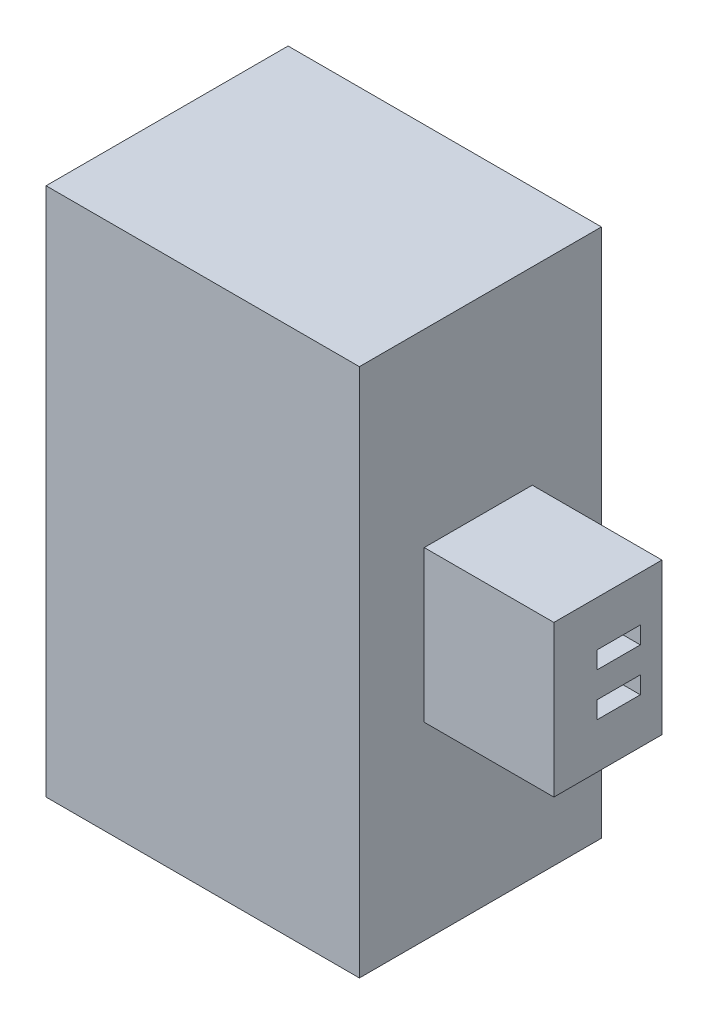
ISO-10303-21;
HEADER;
FILE_DESCRIPTION(('STEP AP214'),'2;1');
FILE_NAME('part.step','',(''),(''),'','','');
FILE_SCHEMA(('AUTOMOTIVE_DESIGN { 1 0 10303 214 1 1 1 1 }'));
ENDSEC;
DATA;
#1=APPLICATION_CONTEXT('core data for automotive mechanical design processes');
#2=APPLICATION_PROTOCOL_DEFINITION('international standard','automotive_design',2000,#1);
#3=PRODUCT_CONTEXT('',#1,'mechanical');
#4=PRODUCT('Part','Part','',(#3));
#5=PRODUCT_RELATED_PRODUCT_CATEGORY('part','',(#4));
#6=PRODUCT_DEFINITION_FORMATION('','',#4);
#7=PRODUCT_DEFINITION_CONTEXT('part definition',#1,'design');
#8=PRODUCT_DEFINITION('design','',#6,#7);
#9=PRODUCT_DEFINITION_SHAPE('','',#8);
#10=(LENGTH_UNIT() NAMED_UNIT(*) SI_UNIT(.MILLI.,.METRE.));
#11=(NAMED_UNIT(*) PLANE_ANGLE_UNIT() SI_UNIT($,.RADIAN.));
#12=(NAMED_UNIT(*) SI_UNIT($,.STERADIAN.) SOLID_ANGLE_UNIT());
#13=UNCERTAINTY_MEASURE_WITH_UNIT(LENGTH_MEASURE(1.E-05),#10,'distance_accuracy_value','');
#14=(GEOMETRIC_REPRESENTATION_CONTEXT(3) GLOBAL_UNCERTAINTY_ASSIGNED_CONTEXT((#13)) GLOBAL_UNIT_ASSIGNED_CONTEXT((#10,
#11,#12)) REPRESENTATION_CONTEXT('',''));
#15=CARTESIAN_POINT('',(0.,0.,0.));
#16=DIRECTION('',(0.,0.,1.));
#17=DIRECTION('',(1.,0.,0.));
#18=AXIS2_PLACEMENT_3D('',#15,#16,#17);
#19=CARTESIAN_POINT('',(0.,0.,5.6));
#20=DIRECTION('',(1.,0.,0.));
#21=DIRECTION('',(0.,0.,-1.));
#22=AXIS2_PLACEMENT_3D('',#19,#20,#21);
#23=PLANE('',#22);
#24=DIRECTION('',(0.,1.,0.));
#25=VECTOR('',#24,1.);
#26=CARTESIAN_POINT('',(0.,-1.62170824512628,4.85));
#27=LINE('',#26,#25);
#28=CARTESIAN_POINT('',(0.,0.750000000000001,4.85));
#29=VERTEX_POINT('',#28);
#30=CARTESIAN_POINT('',(0.,11.5,4.85));
#31=VERTEX_POINT('',#30);
#32=EDGE_CURVE('E172',#29,#31,#27,.T.);
#33=ORIENTED_EDGE('',*,*,#32,.T.);
#34=DIRECTION('',(0.,0.,1.));
#35=VECTOR('',#34,1.);
#36=CARTESIAN_POINT('',(0.,11.5,5.6));
#37=LINE('',#36,#35);
#38=CARTESIAN_POINT('',(0.,11.5,0.));
#39=VERTEX_POINT('',#38);
#40=EDGE_CURVE('E197',#39,#31,#37,.T.);
#41=ORIENTED_EDGE('',*,*,#40,.F.);
#42=DIRECTION('',(0.,-1.,0.));
#43=VECTOR('',#42,1.);
#44=CARTESIAN_POINT('',(0.,0.,0.));
#45=LINE('',#44,#43);
#46=CARTESIAN_POINT('',(0.,0.750000000000001,0.));
#47=VERTEX_POINT('',#46);
#48=EDGE_CURVE('E185',#39,#47,#45,.T.);
#49=ORIENTED_EDGE('',*,*,#48,.T.);
#50=DIRECTION('',(0.,0.,-1.));
#51=VECTOR('',#50,1.);
#52=CARTESIAN_POINT('',(0.,0.750000000000001,5.6));
#53=LINE('',#52,#51);
#54=EDGE_CURVE('E57',#29,#47,#53,.T.);
#55=ORIENTED_EDGE('',*,*,#54,.F.);
#56=EDGE_LOOP('',(#33,#41,#49,#55));
#57=FACE_BOUND('',#56,.T.);
#58=ADVANCED_FACE('F33',(#57),#23,.F.);
#59=CARTESIAN_POINT('',(-2.25,11.5,5.6));
#60=DIRECTION('',(0.,1.,0.));
#61=DIRECTION('',(0.,0.,1.));
#62=AXIS2_PLACEMENT_3D('',#59,#60,#61);
#63=PLANE('',#62);
#64=DIRECTION('',(1.,0.,0.));
#65=VECTOR('',#64,1.);
#66=CARTESIAN_POINT('',(-2.25,11.5,4.85));
#67=LINE('',#66,#65);
#68=CARTESIAN_POINT('',(-2.25,11.5,4.85));
#69=VERTEX_POINT('',#68);
#70=EDGE_CURVE('E177',#69,#31,#67,.T.);
#71=ORIENTED_EDGE('',*,*,#70,.F.);
#72=DIRECTION('',(0.,0.,1.));
#73=VECTOR('',#72,1.);
#74=CARTESIAN_POINT('',(-2.25,11.5,5.6));
#75=LINE('',#74,#73);
#76=CARTESIAN_POINT('',(-2.25,11.5,0.));
#77=VERTEX_POINT('',#76);
#78=EDGE_CURVE('E206',#77,#69,#75,.T.);
#79=ORIENTED_EDGE('',*,*,#78,.F.);
#80=DIRECTION('',(1.,0.,0.));
#81=VECTOR('',#80,1.);
#82=CARTESIAN_POINT('',(-2.25,11.5,0.));
#83=LINE('',#82,#81);
#84=EDGE_CURVE('E208',#77,#39,#83,.T.);
#85=ORIENTED_EDGE('',*,*,#84,.T.);
#86=ORIENTED_EDGE('',*,*,#40,.T.);
#87=EDGE_LOOP('',(#71,#79,#85,#86));
#88=FACE_BOUND('',#87,.T.);
#89=ADVANCED_FACE('F378',(#88),#63,.F.);
#90=CARTESIAN_POINT('',(-2.25,0.750000000000001,5.6));
#91=DIRECTION('',(0.,-1.,0.));
#92=DIRECTION('',(0.,0.,-1.));
#93=AXIS2_PLACEMENT_3D('',#90,#91,#92);
#94=PLANE('',#93);
#95=DIRECTION('',(1.,0.,0.));
#96=VECTOR('',#95,1.);
#97=CARTESIAN_POINT('',(-2.25,0.750000000000001,4.85));
#98=LINE('',#97,#96);
#99=CARTESIAN_POINT('',(-2.25,0.750000000000001,4.85));
#100=VERTEX_POINT('',#99);
#101=EDGE_CURVE('E174',#100,#29,#98,.T.);
#102=ORIENTED_EDGE('',*,*,#101,.T.);
#103=ORIENTED_EDGE('',*,*,#54,.T.);
#104=DIRECTION('',(1.,0.,0.));
#105=VECTOR('',#104,1.);
#106=CARTESIAN_POINT('',(-2.25,0.750000000000001,0.));
#107=LINE('',#106,#105);
#108=CARTESIAN_POINT('',(-2.25,0.750000000000001,0.));
#109=VERTEX_POINT('',#108);
#110=EDGE_CURVE('E195',#109,#47,#107,.T.);
#111=ORIENTED_EDGE('',*,*,#110,.F.);
#112=DIRECTION('',(0.,0.,-1.));
#113=VECTOR('',#112,1.);
#114=CARTESIAN_POINT('',(-2.25,0.750000000000001,5.6));
#115=LINE('',#114,#113);
#116=EDGE_CURVE('E182',#100,#109,#115,.T.);
#117=ORIENTED_EDGE('',*,*,#116,.F.);
#118=EDGE_LOOP('',(#102,#103,#111,#117));
#119=FACE_BOUND('',#118,.T.);
#120=ADVANCED_FACE('F181',(#119),#94,.F.);
#121=CARTESIAN_POINT('',(5.,0.,5.6));
#122=DIRECTION('',(-1.,0.,0.));
#123=DIRECTION('',(0.,0.,1.));
#124=AXIS2_PLACEMENT_3D('',#121,#122,#123);
#125=PLANE('',#124);
#126=DIRECTION('',(0.,1.,0.));
#127=VECTOR('',#126,1.);
#128=CARTESIAN_POINT('',(5.,0.,0.));
#129=LINE('',#128,#127);
#130=CARTESIAN_POINT('',(5.,0.,0.));
#131=VERTEX_POINT('',#130);
#132=CARTESIAN_POINT('',(5.,12.25,0.));
#133=VERTEX_POINT('',#132);
#134=EDGE_CURVE('E320',#131,#133,#129,.T.);
#135=ORIENTED_EDGE('',*,*,#134,.T.);
#136=DIRECTION('',(0.,0.,-1.));
#137=VECTOR('',#136,1.);
#138=CARTESIAN_POINT('',(5.,12.25,5.6));
#139=LINE('',#138,#137);
#140=CARTESIAN_POINT('',(5.,12.25,5.6));
#141=VERTEX_POINT('',#140);
#142=EDGE_CURVE('E41',#141,#133,#139,.T.);
#143=ORIENTED_EDGE('',*,*,#142,.F.);
#144=DIRECTION('',(0.,1.,0.));
#145=VECTOR('',#144,1.);
#146=CARTESIAN_POINT('',(5.,0.,5.6));
#147=LINE('',#146,#145);
#148=CARTESIAN_POINT('',(5.,0.,5.6));
#149=VERTEX_POINT('',#148);
#150=EDGE_CURVE('E312',#149,#141,#147,.T.);
#151=ORIENTED_EDGE('',*,*,#150,.F.);
#152=DIRECTION('',(0.,0.,-1.));
#153=VECTOR('',#152,1.);
#154=CARTESIAN_POINT('',(5.,0.,5.6));
#155=LINE('',#154,#153);
#156=EDGE_CURVE('E11',#149,#131,#155,.T.);
#157=ORIENTED_EDGE('',*,*,#156,.T.);
#158=EDGE_LOOP('',(#135,#143,#151,#157));
#159=FACE_BOUND('',#158,.T.);
#160=DIRECTION('',(0.,-1.,0.));
#161=VECTOR('',#160,1.);
#162=CARTESIAN_POINT('',(5.,7.875,4.1));
#163=LINE('',#162,#161);
#164=CARTESIAN_POINT('',(5.,7.875,4.1));
#165=VERTEX_POINT('',#164);
#166=CARTESIAN_POINT('',(5.,4.375,4.1));
#167=VERTEX_POINT('',#166);
#168=EDGE_CURVE('E277',#165,#167,#163,.T.);
#169=ORIENTED_EDGE('',*,*,#168,.F.);
#170=DIRECTION('',(0.,0.,1.));
#171=VECTOR('',#170,1.);
#172=CARTESIAN_POINT('',(5.,7.875,4.1));
#173=LINE('',#172,#171);
#174=CARTESIAN_POINT('',(5.,7.875,1.6));
#175=VERTEX_POINT('',#174);
#176=EDGE_CURVE('E282',#175,#165,#173,.T.);
#177=ORIENTED_EDGE('',*,*,#176,.F.);
#178=DIRECTION('',(0.,1.,0.));
#179=VECTOR('',#178,1.);
#180=CARTESIAN_POINT('',(5.,7.875,1.6));
#181=LINE('',#180,#179);
#182=CARTESIAN_POINT('',(5.,4.375,1.6));
#183=VERTEX_POINT('',#182);
#184=EDGE_CURVE('E294',#183,#175,#181,.T.);
#185=ORIENTED_EDGE('',*,*,#184,.F.);
#186=DIRECTION('',(0.,0.,-1.));
#187=VECTOR('',#186,1.);
#188=CARTESIAN_POINT('',(5.,4.375,4.1));
#189=LINE('',#188,#187);
#190=EDGE_CURVE('E291',#167,#183,#189,.T.);
#191=ORIENTED_EDGE('',*,*,#190,.F.);
#192=EDGE_LOOP('',(#169,#177,#185,#191));
#193=FACE_BOUND('',#192,.T.);
#194=ADVANCED_FACE('F345',(#159,#193),#125,.F.);
#195=CARTESIAN_POINT('',(0.,0.,5.6));
#196=DIRECTION('',(0.,1.,0.));
#197=DIRECTION('',(0.,0.,1.));
#198=AXIS2_PLACEMENT_3D('',#195,#196,#197);
#199=PLANE('',#198);
#200=DIRECTION('',(1.,0.,0.));
#201=VECTOR('',#200,1.);
#202=CARTESIAN_POINT('',(0.,0.,0.));
#203=LINE('',#202,#201);
#204=CARTESIAN_POINT('',(-2.25,0.,0.));
#205=VERTEX_POINT('',#204);
#206=EDGE_CURVE('E318',#205,#131,#203,.T.);
#207=ORIENTED_EDGE('',*,*,#206,.T.);
#208=ORIENTED_EDGE('',*,*,#156,.F.);
#209=DIRECTION('',(1.,0.,0.));
#210=VECTOR('',#209,1.);
#211=CARTESIAN_POINT('',(0.,0.,5.6));
#212=LINE('',#211,#210);
#213=CARTESIAN_POINT('',(-2.25,0.,5.6));
#214=VERTEX_POINT('',#213);
#215=EDGE_CURVE('E310',#214,#149,#212,.T.);
#216=ORIENTED_EDGE('',*,*,#215,.F.);
#217=DIRECTION('',(0.,0.,1.));
#218=VECTOR('',#217,1.);
#219=CARTESIAN_POINT('',(-2.25,0.,5.6));
#220=LINE('',#219,#218);
#221=EDGE_CURVE('E187',#205,#214,#220,.T.);
#222=ORIENTED_EDGE('',*,*,#221,.F.);
#223=EDGE_LOOP('',(#207,#208,#216,#222));
#224=FACE_BOUND('',#223,.T.);
#225=ADVANCED_FACE('F344',(#224),#199,.F.);
#226=CARTESIAN_POINT('',(0.,12.25,5.6));
#227=DIRECTION('',(0.,-1.,0.));
#228=DIRECTION('',(0.,0.,-1.));
#229=AXIS2_PLACEMENT_3D('',#226,#227,#228);
#230=PLANE('',#229);
#231=DIRECTION('',(-1.,0.,0.));
#232=VECTOR('',#231,1.);
#233=CARTESIAN_POINT('',(0.,12.25,0.));
#234=LINE('',#233,#232);
#235=CARTESIAN_POINT('',(-2.25,12.25,0.));
#236=VERTEX_POINT('',#235);
#237=EDGE_CURVE('E313',#133,#236,#234,.T.);
#238=ORIENTED_EDGE('',*,*,#237,.T.);
#239=DIRECTION('',(0.,0.,-1.));
#240=VECTOR('',#239,1.);
#241=CARTESIAN_POINT('',(-2.25,12.25,5.6));
#242=LINE('',#241,#240);
#243=CARTESIAN_POINT('',(-2.25,12.25,5.6));
#244=VERTEX_POINT('',#243);
#245=EDGE_CURVE('E201',#244,#236,#242,.T.);
#246=ORIENTED_EDGE('',*,*,#245,.F.);
#247=DIRECTION('',(-1.,0.,0.));
#248=VECTOR('',#247,1.);
#249=CARTESIAN_POINT('',(0.,12.25,5.6));
#250=LINE('',#249,#248);
#251=EDGE_CURVE('E315',#141,#244,#250,.T.);
#252=ORIENTED_EDGE('',*,*,#251,.F.);
#253=ORIENTED_EDGE('',*,*,#142,.T.);
#254=EDGE_LOOP('',(#238,#246,#252,#253));
#255=FACE_BOUND('',#254,.T.);
#256=ADVANCED_FACE('F328',(#255),#230,.F.);
#257=CARTESIAN_POINT('',(0.,0.,5.6));
#258=DIRECTION('',(0.,0.,-1.));
#259=DIRECTION('',(-1.,0.,0.));
#260=AXIS2_PLACEMENT_3D('',#257,#258,#259);
#261=PLANE('',#260);
#262=ORIENTED_EDGE('',*,*,#251,.T.);
#263=DIRECTION('',(0.,1.,0.));
#264=VECTOR('',#263,1.);
#265=CARTESIAN_POINT('',(-2.25,12.25,5.6));
#266=LINE('',#265,#264);
#267=EDGE_CURVE('E198',#214,#244,#266,.T.);
#268=ORIENTED_EDGE('',*,*,#267,.F.);
#269=ORIENTED_EDGE('',*,*,#215,.T.);
#270=ORIENTED_EDGE('',*,*,#150,.T.);
#271=EDGE_LOOP('',(#262,#268,#269,#270));
#272=FACE_BOUND('',#271,.T.);
#273=ADVANCED_FACE('F341',(#272),#261,.F.);
#274=CARTESIAN_POINT('',(0.,0.,0.));
#275=DIRECTION('',(0.,0.,-1.));
#276=DIRECTION('',(-1.,0.,0.));
#277=AXIS2_PLACEMENT_3D('',#274,#275,#276);
#278=PLANE('',#277);
#279=ORIENTED_EDGE('',*,*,#48,.F.);
#280=ORIENTED_EDGE('',*,*,#84,.F.);
#281=DIRECTION('',(0.,-1.,0.));
#282=VECTOR('',#281,1.);
#283=CARTESIAN_POINT('',(-2.25,12.25,0.));
#284=LINE('',#283,#282);
#285=EDGE_CURVE('E204',#236,#77,#284,.T.);
#286=ORIENTED_EDGE('',*,*,#285,.F.);
#287=ORIENTED_EDGE('',*,*,#237,.F.);
#288=ORIENTED_EDGE('',*,*,#134,.F.);
#289=ORIENTED_EDGE('',*,*,#206,.F.);
#290=DIRECTION('',(0.,-1.,0.));
#291=VECTOR('',#290,1.);
#292=CARTESIAN_POINT('',(-2.25,0.,0.));
#293=LINE('',#292,#291);
#294=EDGE_CURVE('E193',#109,#205,#293,.T.);
#295=ORIENTED_EDGE('',*,*,#294,.F.);
#296=ORIENTED_EDGE('',*,*,#110,.T.);
#297=EDGE_LOOP('',(#279,#280,#286,#287,#288,#289,#295,#296));
#298=FACE_BOUND('',#297,.T.);
#299=ADVANCED_FACE('F335',(#298),#278,.T.);
#300=CARTESIAN_POINT('',(8.,0.,0.));
#301=DIRECTION('',(1.,0.,0.));
#302=DIRECTION('',(0.,0.,-1.));
#303=AXIS2_PLACEMENT_3D('',#300,#301,#302);
#304=PLANE('',#303);
#305=DIRECTION('',(0.,0.,-1.));
#306=VECTOR('',#305,1.);
#307=CARTESIAN_POINT('',(8.,6.425,3.1));
#308=LINE('',#307,#306);
#309=CARTESIAN_POINT('',(8.,6.425,3.1));
#310=VERTEX_POINT('',#309);
#311=CARTESIAN_POINT('',(8.,6.425,2.1));
#312=VERTEX_POINT('',#311);
#313=EDGE_CURVE('E250',#310,#312,#308,.T.);
#314=ORIENTED_EDGE('',*,*,#313,.F.);
#315=DIRECTION('',(0.,-1.,0.));
#316=VECTOR('',#315,1.);
#317=CARTESIAN_POINT('',(8.,6.825,3.1));
#318=LINE('',#317,#316);
#319=CARTESIAN_POINT('',(8.,6.825,3.1));
#320=VERTEX_POINT('',#319);
#321=EDGE_CURVE('E248',#320,#310,#318,.T.);
#322=ORIENTED_EDGE('',*,*,#321,.F.);
#323=DIRECTION('',(0.,0.,1.));
#324=VECTOR('',#323,1.);
#325=CARTESIAN_POINT('',(8.,6.825,3.1));
#326=LINE('',#325,#324);
#327=CARTESIAN_POINT('',(8.,6.825,2.1));
#328=VERTEX_POINT('',#327);
#329=EDGE_CURVE('E256',#328,#320,#326,.T.);
#330=ORIENTED_EDGE('',*,*,#329,.F.);
#331=DIRECTION('',(0.,1.,0.));
#332=VECTOR('',#331,1.);
#333=CARTESIAN_POINT('',(8.,6.825,2.1));
#334=LINE('',#333,#332);
#335=EDGE_CURVE('E253',#312,#328,#334,.T.);
#336=ORIENTED_EDGE('',*,*,#335,.F.);
#337=EDGE_LOOP('',(#314,#322,#330,#336));
#338=FACE_BOUND('',#337,.T.);
#339=DIRECTION('',(0.,-1.,0.));
#340=VECTOR('',#339,1.);
#341=CARTESIAN_POINT('',(8.,7.875,4.1));
#342=LINE('',#341,#340);
#343=CARTESIAN_POINT('',(8.,7.875,4.1));
#344=VERTEX_POINT('',#343);
#345=CARTESIAN_POINT('',(8.,4.375,4.1));
#346=VERTEX_POINT('',#345);
#347=EDGE_CURVE('E278',#344,#346,#342,.T.);
#348=ORIENTED_EDGE('',*,*,#347,.T.);
#349=DIRECTION('',(0.,0.,-1.));
#350=VECTOR('',#349,1.);
#351=CARTESIAN_POINT('',(8.,4.375,4.1));
#352=LINE('',#351,#350);
#353=CARTESIAN_POINT('',(8.,4.375,1.6));
#354=VERTEX_POINT('',#353);
#355=EDGE_CURVE('E281',#346,#354,#352,.T.);
#356=ORIENTED_EDGE('',*,*,#355,.T.);
#357=DIRECTION('',(0.,1.,0.));
#358=VECTOR('',#357,1.);
#359=CARTESIAN_POINT('',(8.,7.875,1.6));
#360=LINE('',#359,#358);
#361=CARTESIAN_POINT('',(8.,7.875,1.6));
#362=VERTEX_POINT('',#361);
#363=EDGE_CURVE('E284',#354,#362,#360,.T.);
#364=ORIENTED_EDGE('',*,*,#363,.T.);
#365=DIRECTION('',(0.,0.,1.));
#366=VECTOR('',#365,1.);
#367=CARTESIAN_POINT('',(8.,7.875,4.1));
#368=LINE('',#367,#366);
#369=EDGE_CURVE('E286',#362,#344,#368,.T.);
#370=ORIENTED_EDGE('',*,*,#369,.T.);
#371=EDGE_LOOP('',(#348,#356,#364,#370));
#372=FACE_BOUND('',#371,.T.);
#373=DIRECTION('',(0.,0.,-1.));
#374=VECTOR('',#373,1.);
#375=CARTESIAN_POINT('',(8.,5.425,3.1));
#376=LINE('',#375,#374);
#377=CARTESIAN_POINT('',(8.,5.425,3.1));
#378=VERTEX_POINT('',#377);
#379=CARTESIAN_POINT('',(8.,5.425,2.1));
#380=VERTEX_POINT('',#379);
#381=EDGE_CURVE('E617',#378,#380,#376,.T.);
#382=ORIENTED_EDGE('',*,*,#381,.F.);
#383=DIRECTION('',(0.,-1.,0.));
#384=VECTOR('',#383,1.);
#385=CARTESIAN_POINT('',(8.,5.425,3.1));
#386=LINE('',#385,#384);
#387=CARTESIAN_POINT('',(8.,5.825,3.1));
#388=VERTEX_POINT('',#387);
#389=EDGE_CURVE('E211',#388,#378,#386,.T.);
#390=ORIENTED_EDGE('',*,*,#389,.F.);
#391=DIRECTION('',(0.,0.,1.));
#392=VECTOR('',#391,1.);
#393=CARTESIAN_POINT('',(8.,5.825,3.1));
#394=LINE('',#393,#392);
#395=CARTESIAN_POINT('',(8.,5.825,2.1));
#396=VERTEX_POINT('',#395);
#397=EDGE_CURVE('E231',#396,#388,#394,.T.);
#398=ORIENTED_EDGE('',*,*,#397,.F.);
#399=DIRECTION('',(0.,1.,0.));
#400=VECTOR('',#399,1.);
#401=CARTESIAN_POINT('',(8.,5.425,2.1));
#402=LINE('',#401,#400);
#403=EDGE_CURVE('E620',#380,#396,#402,.T.);
#404=ORIENTED_EDGE('',*,*,#403,.F.);
#405=EDGE_LOOP('',(#382,#390,#398,#404));
#406=FACE_BOUND('',#405,.T.);
#407=ADVANCED_FACE('F361',(#338,#372,#406),#304,.T.);
#408=CARTESIAN_POINT('',(8.,7.875,4.1));
#409=DIRECTION('',(0.,0.,-1.));
#410=DIRECTION('',(-1.,0.,0.));
#411=AXIS2_PLACEMENT_3D('',#408,#409,#410);
#412=PLANE('',#411);
#413=ORIENTED_EDGE('',*,*,#168,.T.);
#414=DIRECTION('',(-1.,0.,0.));
#415=VECTOR('',#414,1.);
#416=CARTESIAN_POINT('',(8.,4.375,4.1));
#417=LINE('',#416,#415);
#418=EDGE_CURVE('E307',#346,#167,#417,.T.);
#419=ORIENTED_EDGE('',*,*,#418,.F.);
#420=ORIENTED_EDGE('',*,*,#347,.F.);
#421=DIRECTION('',(-1.,0.,0.));
#422=VECTOR('',#421,1.);
#423=CARTESIAN_POINT('',(8.,7.875,4.1));
#424=LINE('',#423,#422);
#425=EDGE_CURVE('E288',#344,#165,#424,.T.);
#426=ORIENTED_EDGE('',*,*,#425,.T.);
#427=EDGE_LOOP('',(#413,#419,#420,#426));
#428=FACE_BOUND('',#427,.T.);
#429=ADVANCED_FACE('F359',(#428),#412,.F.);
#430=CARTESIAN_POINT('',(8.,4.375,4.1));
#431=DIRECTION('',(0.,1.,0.));
#432=DIRECTION('',(0.,0.,1.));
#433=AXIS2_PLACEMENT_3D('',#430,#431,#432);
#434=PLANE('',#433);
#435=ORIENTED_EDGE('',*,*,#190,.T.);
#436=DIRECTION('',(-1.,0.,0.));
#437=VECTOR('',#436,1.);
#438=CARTESIAN_POINT('',(8.,4.375,1.6));
#439=LINE('',#438,#437);
#440=EDGE_CURVE('E304',#354,#183,#439,.T.);
#441=ORIENTED_EDGE('',*,*,#440,.F.);
#442=ORIENTED_EDGE('',*,*,#355,.F.);
#443=ORIENTED_EDGE('',*,*,#418,.T.);
#444=EDGE_LOOP('',(#435,#441,#442,#443));
#445=FACE_BOUND('',#444,.T.);
#446=ADVANCED_FACE('F368',(#445),#434,.F.);
#447=CARTESIAN_POINT('',(8.,7.875,1.6));
#448=DIRECTION('',(0.,0.,1.));
#449=DIRECTION('',(1.,0.,0.));
#450=AXIS2_PLACEMENT_3D('',#447,#448,#449);
#451=PLANE('',#450);
#452=ORIENTED_EDGE('',*,*,#184,.T.);
#453=DIRECTION('',(-1.,0.,0.));
#454=VECTOR('',#453,1.);
#455=CARTESIAN_POINT('',(8.,7.875,1.6));
#456=LINE('',#455,#454);
#457=EDGE_CURVE('E301',#362,#175,#456,.T.);
#458=ORIENTED_EDGE('',*,*,#457,.F.);
#459=ORIENTED_EDGE('',*,*,#363,.F.);
#460=ORIENTED_EDGE('',*,*,#440,.T.);
#461=EDGE_LOOP('',(#452,#458,#459,#460));
#462=FACE_BOUND('',#461,.T.);
#463=ADVANCED_FACE('F366',(#462),#451,.F.);
#464=CARTESIAN_POINT('',(8.,7.875,4.1));
#465=DIRECTION('',(0.,-1.,0.));
#466=DIRECTION('',(0.,0.,-1.));
#467=AXIS2_PLACEMENT_3D('',#464,#465,#466);
#468=PLANE('',#467);
#469=ORIENTED_EDGE('',*,*,#176,.T.);
#470=ORIENTED_EDGE('',*,*,#425,.F.);
#471=ORIENTED_EDGE('',*,*,#369,.F.);
#472=ORIENTED_EDGE('',*,*,#457,.T.);
#473=EDGE_LOOP('',(#469,#470,#471,#472));
#474=FACE_BOUND('',#473,.T.);
#475=ADVANCED_FACE('F355',(#474),#468,.F.);
#476=CARTESIAN_POINT('',(8.,6.825,3.1));
#477=DIRECTION('',(0.,0.,-1.));
#478=DIRECTION('',(-1.,0.,0.));
#479=AXIS2_PLACEMENT_3D('',#476,#477,#478);
#480=PLANE('',#479);
#481=DIRECTION('',(0.,-1.,0.));
#482=VECTOR('',#481,1.);
#483=CARTESIAN_POINT('',(5.,6.825,3.1));
#484=LINE('',#483,#482);
#485=CARTESIAN_POINT('',(5.,6.825,3.1));
#486=VERTEX_POINT('',#485);
#487=CARTESIAN_POINT('',(5.,6.425,3.1));
#488=VERTEX_POINT('',#487);
#489=EDGE_CURVE('E247',#486,#488,#484,.T.);
#490=ORIENTED_EDGE('',*,*,#489,.F.);
#491=DIRECTION('',(-1.,0.,0.));
#492=VECTOR('',#491,1.);
#493=CARTESIAN_POINT('',(8.,6.825,3.1));
#494=LINE('',#493,#492);
#495=EDGE_CURVE('E258',#320,#486,#494,.T.);
#496=ORIENTED_EDGE('',*,*,#495,.F.);
#497=ORIENTED_EDGE('',*,*,#321,.T.);
#498=DIRECTION('',(-1.,0.,0.));
#499=VECTOR('',#498,1.);
#500=CARTESIAN_POINT('',(8.,6.425,3.1));
#501=LINE('',#500,#499);
#502=EDGE_CURVE('E274',#310,#488,#501,.T.);
#503=ORIENTED_EDGE('',*,*,#502,.T.);
#504=EDGE_LOOP('',(#490,#496,#497,#503));
#505=FACE_BOUND('',#504,.T.);
#506=ADVANCED_FACE('F416',(#505),#480,.T.);
#507=CARTESIAN_POINT('',(8.,6.425,3.1));
#508=DIRECTION('',(0.,1.,0.));
#509=DIRECTION('',(0.,0.,1.));
#510=AXIS2_PLACEMENT_3D('',#507,#508,#509);
#511=PLANE('',#510);
#512=DIRECTION('',(0.,0.,-1.));
#513=VECTOR('',#512,1.);
#514=CARTESIAN_POINT('',(5.,6.425,3.1));
#515=LINE('',#514,#513);
#516=CARTESIAN_POINT('',(5.,6.425,2.1));
#517=VERTEX_POINT('',#516);
#518=EDGE_CURVE('E261',#488,#517,#515,.T.);
#519=ORIENTED_EDGE('',*,*,#518,.F.);
#520=ORIENTED_EDGE('',*,*,#502,.F.);
#521=ORIENTED_EDGE('',*,*,#313,.T.);
#522=DIRECTION('',(-1.,0.,0.));
#523=VECTOR('',#522,1.);
#524=CARTESIAN_POINT('',(8.,6.425,2.1));
#525=LINE('',#524,#523);
#526=EDGE_CURVE('E272',#312,#517,#525,.T.);
#527=ORIENTED_EDGE('',*,*,#526,.T.);
#528=EDGE_LOOP('',(#519,#520,#521,#527));
#529=FACE_BOUND('',#528,.T.);
#530=ADVANCED_FACE('F412',(#529),#511,.T.);
#531=CARTESIAN_POINT('',(8.,6.825,2.1));
#532=DIRECTION('',(0.,0.,1.));
#533=DIRECTION('',(1.,0.,0.));
#534=AXIS2_PLACEMENT_3D('',#531,#532,#533);
#535=PLANE('',#534);
#536=DIRECTION('',(0.,1.,0.));
#537=VECTOR('',#536,1.);
#538=CARTESIAN_POINT('',(5.,6.825,2.1));
#539=LINE('',#538,#537);
#540=CARTESIAN_POINT('',(5.,6.825,2.1));
#541=VERTEX_POINT('',#540);
#542=EDGE_CURVE('E264',#517,#541,#539,.T.);
#543=ORIENTED_EDGE('',*,*,#542,.F.);
#544=ORIENTED_EDGE('',*,*,#526,.F.);
#545=ORIENTED_EDGE('',*,*,#335,.T.);
#546=DIRECTION('',(-1.,0.,0.));
#547=VECTOR('',#546,1.);
#548=CARTESIAN_POINT('',(8.,6.825,2.1));
#549=LINE('',#548,#547);
#550=EDGE_CURVE('E270',#328,#541,#549,.T.);
#551=ORIENTED_EDGE('',*,*,#550,.T.);
#552=EDGE_LOOP('',(#543,#544,#545,#551));
#553=FACE_BOUND('',#552,.T.);
#554=ADVANCED_FACE('F408',(#553),#535,.T.);
#555=CARTESIAN_POINT('',(8.,6.825,3.1));
#556=DIRECTION('',(0.,-1.,0.));
#557=DIRECTION('',(0.,0.,-1.));
#558=AXIS2_PLACEMENT_3D('',#555,#556,#557);
#559=PLANE('',#558);
#560=DIRECTION('',(0.,0.,1.));
#561=VECTOR('',#560,1.);
#562=CARTESIAN_POINT('',(5.,6.825,3.1));
#563=LINE('',#562,#561);
#564=EDGE_CURVE('E251',#541,#486,#563,.T.);
#565=ORIENTED_EDGE('',*,*,#564,.F.);
#566=ORIENTED_EDGE('',*,*,#550,.F.);
#567=ORIENTED_EDGE('',*,*,#329,.T.);
#568=ORIENTED_EDGE('',*,*,#495,.T.);
#569=EDGE_LOOP('',(#565,#566,#567,#568));
#570=FACE_BOUND('',#569,.T.);
#571=ADVANCED_FACE('F404',(#570),#559,.T.);
#572=CARTESIAN_POINT('',(8.,5.425,3.1));
#573=DIRECTION('',(0.,0.,-1.));
#574=DIRECTION('',(-1.,0.,0.));
#575=AXIS2_PLACEMENT_3D('',#572,#573,#574);
#576=PLANE('',#575);
#577=DIRECTION('',(0.,-1.,0.));
#578=VECTOR('',#577,1.);
#579=CARTESIAN_POINT('',(5.,5.425,3.1));
#580=LINE('',#579,#578);
#581=CARTESIAN_POINT('',(5.,5.825,3.1));
#582=VERTEX_POINT('',#581);
#583=CARTESIAN_POINT('',(5.,5.425,3.1));
#584=VERTEX_POINT('',#583);
#585=EDGE_CURVE('E217',#582,#584,#580,.T.);
#586=ORIENTED_EDGE('',*,*,#585,.F.);
#587=DIRECTION('',(-1.,0.,0.));
#588=VECTOR('',#587,1.);
#589=CARTESIAN_POINT('',(8.,5.825,3.1));
#590=LINE('',#589,#588);
#591=EDGE_CURVE('E238',#388,#582,#590,.T.);
#592=ORIENTED_EDGE('',*,*,#591,.F.);
#593=ORIENTED_EDGE('',*,*,#389,.T.);
#594=DIRECTION('',(-1.,0.,0.));
#595=VECTOR('',#594,1.);
#596=CARTESIAN_POINT('',(8.,5.425,3.1));
#597=LINE('',#596,#595);
#598=EDGE_CURVE('E244',#378,#584,#597,.T.);
#599=ORIENTED_EDGE('',*,*,#598,.T.);
#600=EDGE_LOOP('',(#586,#592,#593,#599));
#601=FACE_BOUND('',#600,.T.);
#602=ADVANCED_FACE('F400',(#601),#576,.T.);
#603=CARTESIAN_POINT('',(8.,5.425,3.1));
#604=DIRECTION('',(0.,1.,0.));
#605=DIRECTION('',(0.,0.,1.));
#606=AXIS2_PLACEMENT_3D('',#603,#604,#605);
#607=PLANE('',#606);
#608=DIRECTION('',(0.,0.,-1.));
#609=VECTOR('',#608,1.);
#610=CARTESIAN_POINT('',(5.,5.425,3.1));
#611=LINE('',#610,#609);
#612=CARTESIAN_POINT('',(5.,5.425,2.1));
#613=VERTEX_POINT('',#612);
#614=EDGE_CURVE('E222',#584,#613,#611,.T.);
#615=ORIENTED_EDGE('',*,*,#614,.F.);
#616=ORIENTED_EDGE('',*,*,#598,.F.);
#617=ORIENTED_EDGE('',*,*,#381,.T.);
#618=DIRECTION('',(-1.,0.,0.));
#619=VECTOR('',#618,1.);
#620=CARTESIAN_POINT('',(8.,5.425,2.1));
#621=LINE('',#620,#619);
#622=EDGE_CURVE('E242',#380,#613,#621,.T.);
#623=ORIENTED_EDGE('',*,*,#622,.T.);
#624=EDGE_LOOP('',(#615,#616,#617,#623));
#625=FACE_BOUND('',#624,.T.);
#626=ADVANCED_FACE('F396',(#625),#607,.T.);
#627=CARTESIAN_POINT('',(8.,5.425,2.1));
#628=DIRECTION('',(0.,0.,1.));
#629=DIRECTION('',(1.,0.,0.));
#630=AXIS2_PLACEMENT_3D('',#627,#628,#629);
#631=PLANE('',#630);
#632=DIRECTION('',(0.,1.,0.));
#633=VECTOR('',#632,1.);
#634=CARTESIAN_POINT('',(5.,5.425,2.1));
#635=LINE('',#634,#633);
#636=CARTESIAN_POINT('',(5.,5.825,2.1));
#637=VERTEX_POINT('',#636);
#638=EDGE_CURVE('E228',#613,#637,#635,.T.);
#639=ORIENTED_EDGE('',*,*,#638,.F.);
#640=ORIENTED_EDGE('',*,*,#622,.F.);
#641=ORIENTED_EDGE('',*,*,#403,.T.);
#642=DIRECTION('',(-1.,0.,0.));
#643=VECTOR('',#642,1.);
#644=CARTESIAN_POINT('',(8.,5.825,2.1));
#645=LINE('',#644,#643);
#646=EDGE_CURVE('E240',#396,#637,#645,.T.);
#647=ORIENTED_EDGE('',*,*,#646,.T.);
#648=EDGE_LOOP('',(#639,#640,#641,#647));
#649=FACE_BOUND('',#648,.T.);
#650=ADVANCED_FACE('F392',(#649),#631,.T.);
#651=CARTESIAN_POINT('',(8.,5.825,3.1));
#652=DIRECTION('',(0.,-1.,0.));
#653=DIRECTION('',(0.,0.,-1.));
#654=AXIS2_PLACEMENT_3D('',#651,#652,#653);
#655=PLANE('',#654);
#656=DIRECTION('',(0.,0.,1.));
#657=VECTOR('',#656,1.);
#658=CARTESIAN_POINT('',(5.,5.825,3.1));
#659=LINE('',#658,#657);
#660=EDGE_CURVE('E236',#637,#582,#659,.T.);
#661=ORIENTED_EDGE('',*,*,#660,.F.);
#662=ORIENTED_EDGE('',*,*,#646,.F.);
#663=ORIENTED_EDGE('',*,*,#397,.T.);
#664=ORIENTED_EDGE('',*,*,#591,.T.);
#665=EDGE_LOOP('',(#661,#662,#663,#664));
#666=FACE_BOUND('',#665,.T.);
#667=ADVANCED_FACE('F389',(#666),#655,.T.);
#668=ORIENTED_EDGE('',*,*,#564,.T.);
#669=ORIENTED_EDGE('',*,*,#489,.T.);
#670=ORIENTED_EDGE('',*,*,#518,.T.);
#671=ORIENTED_EDGE('',*,*,#542,.T.);
#672=EDGE_LOOP('',(#668,#669,#670,#671));
#673=FACE_BOUND('',#672,.T.);
#674=ADVANCED_FACE('F349',(#673),#125,.F.);
#675=ORIENTED_EDGE('',*,*,#660,.T.);
#676=ORIENTED_EDGE('',*,*,#585,.T.);
#677=ORIENTED_EDGE('',*,*,#614,.T.);
#678=ORIENTED_EDGE('',*,*,#638,.T.);
#679=EDGE_LOOP('',(#675,#676,#677,#678));
#680=FACE_BOUND('',#679,.T.);
#681=ADVANCED_FACE('F350',(#680),#125,.F.);
#682=CARTESIAN_POINT('',(-2.25,0.,0.));
#683=DIRECTION('',(1.,0.,0.));
#684=DIRECTION('',(0.,0.,-1.));
#685=AXIS2_PLACEMENT_3D('',#682,#683,#684);
#686=PLANE('',#685);
#687=ORIENTED_EDGE('',*,*,#267,.T.);
#688=ORIENTED_EDGE('',*,*,#245,.T.);
#689=ORIENTED_EDGE('',*,*,#285,.T.);
#690=ORIENTED_EDGE('',*,*,#78,.T.);
#691=DIRECTION('',(0.,1.,0.));
#692=VECTOR('',#691,1.);
#693=CARTESIAN_POINT('',(-2.25,-1.62170824512628,4.85));
#694=LINE('',#693,#692);
#695=EDGE_CURVE('E49',#100,#69,#694,.T.);
#696=ORIENTED_EDGE('',*,*,#695,.F.);
#697=ORIENTED_EDGE('',*,*,#116,.T.);
#698=ORIENTED_EDGE('',*,*,#294,.T.);
#699=ORIENTED_EDGE('',*,*,#221,.T.);
#700=EDGE_LOOP('',(#687,#688,#689,#690,#696,#697,#698,#699));
#701=FACE_BOUND('',#700,.T.);
#702=ADVANCED_FACE('F336',(#701),#686,.F.);
#703=CARTESIAN_POINT('',(-2.25,-1.62170824512628,4.85));
#704=DIRECTION('',(0.,0.,1.));
#705=DIRECTION('',(1.,0.,0.));
#706=AXIS2_PLACEMENT_3D('',#703,#704,#705);
#707=PLANE('',#706);
#708=ORIENTED_EDGE('',*,*,#101,.F.);
#709=ORIENTED_EDGE('',*,*,#695,.T.);
#710=ORIENTED_EDGE('',*,*,#70,.T.);
#711=ORIENTED_EDGE('',*,*,#32,.F.);
#712=EDGE_LOOP('',(#708,#709,#710,#711));
#713=FACE_BOUND('',#712,.T.);
#714=ADVANCED_FACE('F173',(#713),#707,.F.);
#715=CLOSED_SHELL('',(#58,#89,#120,#194,#225,#256,#273,#299,#407,#429,#446,#463,#475,#506,#530,
#554,#571,#602,#626,#650,#667,#674,#681,#702,#714));
#716=MANIFOLD_SOLID_BREP('B2',#715);
#717=ADVANCED_BREP_SHAPE_REPRESENTATION('',(#18,#716),#14);
#718=SHAPE_DEFINITION_REPRESENTATION(#9,#717);
ENDSEC;
END-ISO-10303-21;
